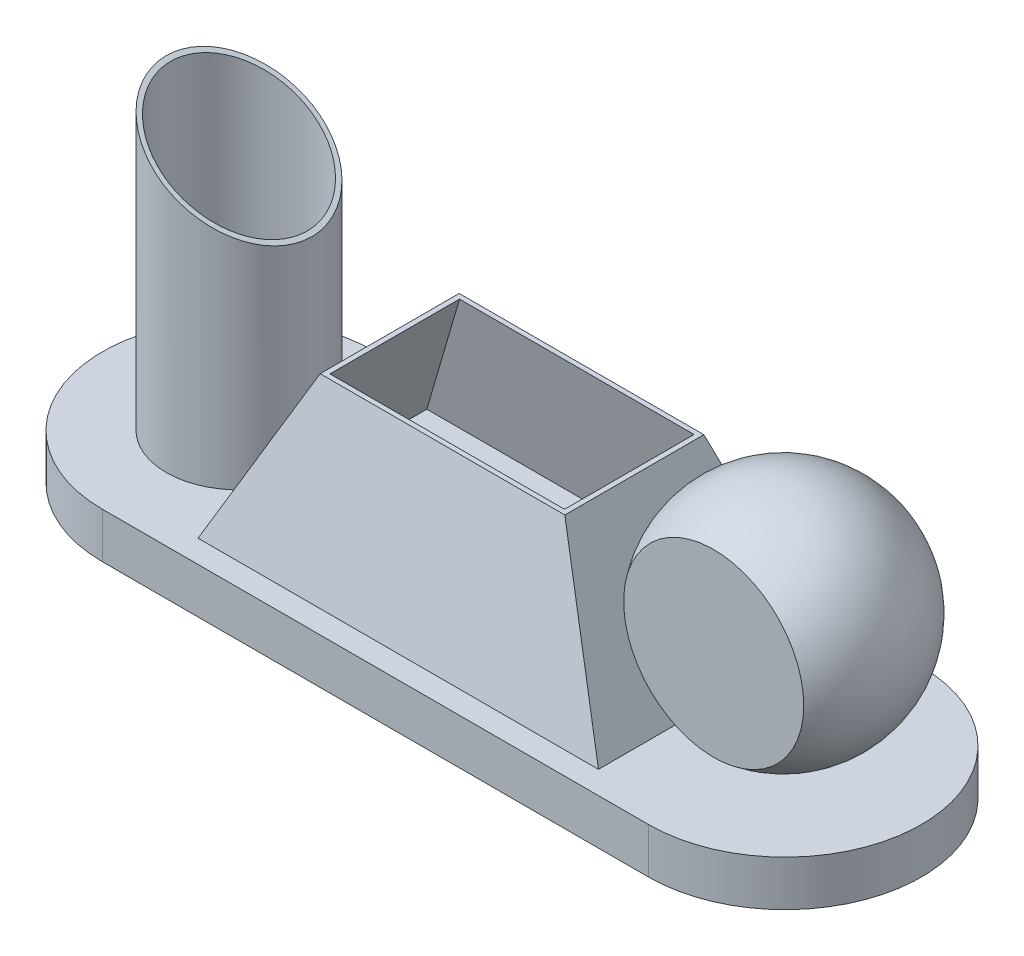
ISO-10303-21;
HEADER;
FILE_DESCRIPTION(('STEP AP214'),'2;1');
FILE_NAME('part.step','',(''),(''),'','','');
FILE_SCHEMA(('AUTOMOTIVE_DESIGN { 1 0 10303 214 1 1 1 1 }'));
ENDSEC;
DATA;
#1=APPLICATION_CONTEXT('core data for automotive mechanical design processes');
#2=APPLICATION_PROTOCOL_DEFINITION('international standard','automotive_design',2000,#1);
#3=PRODUCT_CONTEXT('',#1,'mechanical');
#4=PRODUCT('Part','Part','',(#3));
#5=PRODUCT_RELATED_PRODUCT_CATEGORY('part','',(#4));
#6=PRODUCT_DEFINITION_FORMATION('','',#4);
#7=PRODUCT_DEFINITION_CONTEXT('part definition',#1,'design');
#8=PRODUCT_DEFINITION('design','',#6,#7);
#9=PRODUCT_DEFINITION_SHAPE('','',#8);
#10=(LENGTH_UNIT() NAMED_UNIT(*) SI_UNIT(.MILLI.,.METRE.));
#11=(NAMED_UNIT(*) PLANE_ANGLE_UNIT() SI_UNIT($,.RADIAN.));
#12=(NAMED_UNIT(*) SI_UNIT($,.STERADIAN.) SOLID_ANGLE_UNIT());
#13=UNCERTAINTY_MEASURE_WITH_UNIT(LENGTH_MEASURE(1.E-05),#10,'distance_accuracy_value','');
#14=(GEOMETRIC_REPRESENTATION_CONTEXT(3) GLOBAL_UNCERTAINTY_ASSIGNED_CONTEXT((#13)) GLOBAL_UNIT_ASSIGNED_CONTEXT((#10,
#11,#12)) REPRESENTATION_CONTEXT('',''));
#15=CARTESIAN_POINT('',(0.,0.,0.));
#16=DIRECTION('',(0.,0.,1.));
#17=DIRECTION('',(1.,0.,0.));
#18=AXIS2_PLACEMENT_3D('',#15,#16,#17);
#19=CARTESIAN_POINT('',(59.6055106363738,35.,0.));
#20=DIRECTION('',(0.,1.,0.));
#21=DIRECTION('',(1.,0.,0.));
#22=AXIS2_PLACEMENT_3D('',#19,#20,#21);
#23=SPHERICAL_SURFACE('',#22,25.);
#24=CARTESIAN_POINT('',(59.6055106363738,35.,0.));
#25=DIRECTION('',(0.,0.,1.));
#26=DIRECTION('',(1.,0.,0.));
#27=AXIS2_PLACEMENT_3D('',#24,#25,#26);
#28=SPHERICAL_SURFACE('',#27,25.);
#29=CARTESIAN_POINT('',(59.6055106363738,35.,15.2777777777778));
#30=DIRECTION('',(0.,0.,1.));
#31=DIRECTION('',(1.,0.,0.));
#32=AXIS2_PLACEMENT_3D('',#29,#30,#31);
#33=CIRCLE('',#32,19.7886206232986);
#34=CARTESIAN_POINT('',(79.3941312596724,35.,15.2777777777778));
#35=VERTEX_POINT('',#34);
#36=EDGE_CURVE('E12',#35,#35,#33,.F.);
#37=ORIENTED_EDGE('',*,*,#36,.T.);
#38=EDGE_LOOP('',(#37));
#39=FACE_BOUND('',#38,.T.);
#40=ADVANCED_FACE('F44',(#39),#28,.T.);
#41=CARTESIAN_POINT('',(59.6055106363738,35.,15.2777777777778));
#42=DIRECTION('',(0.,0.,1.));
#43=DIRECTION('',(1.,0.,0.));
#44=AXIS2_PLACEMENT_3D('',#41,#42,#43);
#45=PLANE('',#44);
#46=ORIENTED_EDGE('',*,*,#36,.F.);
#47=EDGE_LOOP('',(#46));
#48=FACE_BOUND('',#47,.T.);
#49=ADVANCED_FACE('F52',(#48),#45,.T.);
#50=CLOSED_SHELL('',(#40,#49));
#51=MANIFOLD_SOLID_BREP('B2',#50);
#52=CARTESIAN_POINT('',(-60.,100.,0.));
#53=DIRECTION('',(0.,-1.,0.));
#54=DIRECTION('',(0.,0.,-1.));
#55=AXIS2_PLACEMENT_3D('',#52,#53,#54);
#56=CYLINDRICAL_SURFACE('',#55,16.);
#57=CARTESIAN_POINT('',(-60.,64.1167089131678,0.));
#58=DIRECTION('',(-0.500000000000004,-0.866025403784436,0.));
#59=DIRECTION('',(0.866025403784436,-0.500000000000004,0.));
#60=AXIS2_PLACEMENT_3D('',#57,#58,#59);
#61=ELLIPSE('',#60,18.4752086140681,16.);
#62=CARTESIAN_POINT('',(-44.,54.8791046061337,0.));
#63=VERTEX_POINT('',#62);
#64=EDGE_CURVE('E83',#63,#63,#61,.T.);
#65=ORIENTED_EDGE('',*,*,#64,.T.);
#66=EDGE_LOOP('',(#65));
#67=FACE_BOUND('',#66,.T.);
#68=CARTESIAN_POINT('',(-60.,10.,0.));
#69=DIRECTION('',(0.,1.,0.));
#70=DIRECTION('',(0.,0.,1.));
#71=AXIS2_PLACEMENT_3D('',#68,#69,#70);
#72=CIRCLE('',#71,16.);
#73=CARTESIAN_POINT('',(-60.,10.,16.));
#74=VERTEX_POINT('',#73);
#75=EDGE_CURVE('E43',#74,#74,#72,.T.);
#76=ORIENTED_EDGE('',*,*,#75,.T.);
#77=EDGE_LOOP('',(#76));
#78=FACE_BOUND('',#77,.T.);
#79=ADVANCED_FACE('F80',(#67,#78),#56,.T.);
#80=CARTESIAN_POINT('',(-60.,10.,0.));
#81=DIRECTION('',(0.,1.,0.));
#82=DIRECTION('',(0.,0.,1.));
#83=AXIS2_PLACEMENT_3D('',#80,#81,#82);
#84=PLANE('',#83);
#85=ORIENTED_EDGE('',*,*,#75,.F.);
#86=EDGE_LOOP('',(#85));
#87=FACE_BOUND('',#86,.T.);
#88=ADVANCED_FACE('F110',(#87),#84,.F.);
#89=CARTESIAN_POINT('',(-26.8888888888889,45.,-45.));
#90=DIRECTION('',(-0.500000000000004,-0.866025403784436,0.));
#91=DIRECTION('',(0.866025403784436,-0.500000000000004,0.));
#92=AXIS2_PLACEMENT_3D('',#89,#90,#91);
#93=PLANE('',#92);
#94=CARTESIAN_POINT('',(-60.,64.1167089131678,0.));
#95=DIRECTION('',(-0.500000000000004,-0.866025403784436,0.));
#96=DIRECTION('',(0.866025403784436,-0.500000000000004,0.));
#97=AXIS2_PLACEMENT_3D('',#94,#95,#96);
#98=ELLIPSE('',#97,17.3205080756888,15.);
#99=CARTESIAN_POINT('',(-45.,55.4564548753233,0.));
#100=VERTEX_POINT('',#99);
#101=EDGE_CURVE('E92',#100,#100,#98,.T.);
#102=ORIENTED_EDGE('',*,*,#101,.T.);
#103=EDGE_LOOP('',(#102));
#104=FACE_BOUND('',#103,.T.);
#105=ORIENTED_EDGE('',*,*,#64,.F.);
#106=EDGE_LOOP('',(#105));
#107=FACE_BOUND('',#106,.T.);
#108=ADVANCED_FACE('F102',(#104,#107),#93,.F.);
#109=CARTESIAN_POINT('',(-60.,100.,0.));
#110=DIRECTION('',(0.,-1.,0.));
#111=DIRECTION('',(0.,0.,-1.));
#112=AXIS2_PLACEMENT_3D('',#109,#110,#111);
#113=CYLINDRICAL_SURFACE('',#112,15.);
#114=ORIENTED_EDGE('',*,*,#101,.F.);
#115=EDGE_LOOP('',(#114));
#116=FACE_BOUND('',#115,.T.);
#117=CARTESIAN_POINT('',(-60.,11.,0.));
#118=DIRECTION('',(0.,1.,0.));
#119=DIRECTION('',(0.,0.,1.));
#120=AXIS2_PLACEMENT_3D('',#117,#118,#119);
#121=CIRCLE('',#120,15.);
#122=CARTESIAN_POINT('',(-60.,11.,15.));
#123=VERTEX_POINT('',#122);
#124=EDGE_CURVE('E90',#123,#123,#121,.T.);
#125=ORIENTED_EDGE('',*,*,#124,.F.);
#126=EDGE_LOOP('',(#125));
#127=FACE_BOUND('',#126,.T.);
#128=ADVANCED_FACE('F100',(#116,#127),#113,.F.);
#129=CARTESIAN_POINT('',(-60.,11.,0.));
#130=DIRECTION('',(0.,1.,0.));
#131=DIRECTION('',(0.,0.,1.));
#132=AXIS2_PLACEMENT_3D('',#129,#130,#131);
#133=PLANE('',#132);
#134=ORIENTED_EDGE('',*,*,#124,.T.);
#135=EDGE_LOOP('',(#134));
#136=FACE_BOUND('',#135,.T.);
#137=ADVANCED_FACE('F98',(#136),#133,.T.);
#138=CLOSED_SHELL('',(#79,#88,#108,#128,#137));
#139=MANIFOLD_SOLID_BREP('B7',#138);
#140=CARTESIAN_POINT('',(44.,10.,25.));
#141=DIRECTION('',(0.,1.,0.));
#142=DIRECTION('',(0.,0.,1.));
#143=AXIS2_PLACEMENT_3D('',#140,#141,#142);
#144=PLANE('',#143);
#145=DIRECTION('',(0.,0.,-1.));
#146=VECTOR('',#145,1.);
#147=CARTESIAN_POINT('',(44.,10.,-25.));
#148=LINE('',#147,#146);
#149=CARTESIAN_POINT('',(44.,10.,25.));
#150=VERTEX_POINT('',#149);
#151=CARTESIAN_POINT('',(44.,10.,-25.));
#152=VERTEX_POINT('',#151);
#153=EDGE_CURVE('E380',#150,#152,#148,.T.);
#154=ORIENTED_EDGE('',*,*,#153,.F.);
#155=DIRECTION('',(1.,0.,0.));
#156=VECTOR('',#155,1.);
#157=CARTESIAN_POINT('',(-44.,10.,25.));
#158=LINE('',#157,#156);
#159=CARTESIAN_POINT('',(-44.,10.,25.));
#160=VERTEX_POINT('',#159);
#161=EDGE_CURVE('E373',#160,#150,#158,.T.);
#162=ORIENTED_EDGE('',*,*,#161,.F.);
#163=DIRECTION('',(0.,0.,1.));
#164=VECTOR('',#163,1.);
#165=CARTESIAN_POINT('',(-44.,10.,-25.));
#166=LINE('',#165,#164);
#167=CARTESIAN_POINT('',(-44.,10.,-25.));
#168=VERTEX_POINT('',#167);
#169=EDGE_CURVE('E300',#168,#160,#166,.T.);
#170=ORIENTED_EDGE('',*,*,#169,.F.);
#171=DIRECTION('',(-1.,0.,0.));
#172=VECTOR('',#171,1.);
#173=CARTESIAN_POINT('',(-44.,10.,-25.));
#174=LINE('',#173,#172);
#175=EDGE_CURVE('E169',#152,#168,#174,.T.);
#176=ORIENTED_EDGE('',*,*,#175,.F.);
#177=EDGE_LOOP('',(#154,#162,#170,#176));
#178=FACE_BOUND('',#177,.T.);
#179=ADVANCED_FACE('F160',(#178),#144,.F.);
#180=CARTESIAN_POINT('',(44.,10.,25.));
#181=DIRECTION('',(0.,-0.267643863786095,-0.963517909629941));
#182=DIRECTION('',(0.,0.963517909629941,-0.267643863786095));
#183=AXIS2_PLACEMENT_3D('',#180,#181,#182);
#184=PLANE('',#183);
#185=DIRECTION('',(-0.426141376923608,0.871652816434652,-0.242125782342959));
#186=VECTOR('',#185,1.);
#187=CARTESIAN_POINT('',(44.,10.,25.));
#188=LINE('',#187,#186);
#189=CARTESIAN_POINT('',(26.8888888888889,45.,15.2777777777778));
#190=VERTEX_POINT('',#189);
#191=EDGE_CURVE('E291',#150,#190,#188,.T.);
#192=ORIENTED_EDGE('',*,*,#191,.T.);
#193=DIRECTION('',(-1.,0.,0.));
#194=VECTOR('',#193,1.);
#195=CARTESIAN_POINT('',(44.,45.,15.2777777777778));
#196=LINE('',#195,#194);
#197=CARTESIAN_POINT('',(-26.8888888888889,45.,15.2777777777778));
#198=VERTEX_POINT('',#197);
#199=EDGE_CURVE('E270',#190,#198,#196,.T.);
#200=ORIENTED_EDGE('',*,*,#199,.T.);
#201=DIRECTION('',(0.426141376923608,0.871652816434652,-0.242125782342959));
#202=VECTOR('',#201,1.);
#203=CARTESIAN_POINT('',(-44.,10.,25.));
#204=LINE('',#203,#202);
#205=EDGE_CURVE('E306',#160,#198,#204,.T.);
#206=ORIENTED_EDGE('',*,*,#205,.F.);
#207=ORIENTED_EDGE('',*,*,#161,.T.);
#208=EDGE_LOOP('',(#192,#200,#206,#207));
#209=FACE_BOUND('',#208,.T.);
#210=ADVANCED_FACE('F318',(#209),#184,.F.);
#211=CARTESIAN_POINT('',(-44.,10.,25.));
#212=DIRECTION('',(0.898384360919201,-0.439210132004943,0.));
#213=DIRECTION('',(0.439210132004943,0.898384360919201,0.));
#214=AXIS2_PLACEMENT_3D('',#211,#212,#213);
#215=PLANE('',#214);
#216=ORIENTED_EDGE('',*,*,#205,.T.);
#217=DIRECTION('',(0.,0.,-1.));
#218=VECTOR('',#217,1.);
#219=CARTESIAN_POINT('',(-26.8888888888889,45.,25.));
#220=LINE('',#219,#218);
#221=CARTESIAN_POINT('',(-26.8888888888889,45.,-15.2777777777778));
#222=VERTEX_POINT('',#221);
#223=EDGE_CURVE('E267',#198,#222,#220,.T.);
#224=ORIENTED_EDGE('',*,*,#223,.T.);
#225=DIRECTION('',(0.426141376923608,0.871652816434652,0.242125782342959));
#226=VECTOR('',#225,1.);
#227=CARTESIAN_POINT('',(-44.,10.,-25.));
#228=LINE('',#227,#226);
#229=EDGE_CURVE('E273',#168,#222,#228,.T.);
#230=ORIENTED_EDGE('',*,*,#229,.F.);
#231=ORIENTED_EDGE('',*,*,#169,.T.);
#232=EDGE_LOOP('',(#216,#224,#230,#231));
#233=FACE_BOUND('',#232,.T.);
#234=ADVANCED_FACE('F308',(#233),#215,.F.);
#235=CARTESIAN_POINT('',(44.,10.,-25.));
#236=DIRECTION('',(-0.898384360919201,-0.439210132004943,0.));
#237=DIRECTION('',(0.439210132004943,-0.898384360919201,0.));
#238=AXIS2_PLACEMENT_3D('',#235,#236,#237);
#239=PLANE('',#238);
#240=DIRECTION('',(0.,0.,1.));
#241=VECTOR('',#240,1.);
#242=CARTESIAN_POINT('',(26.8888888888889,45.,-25.));
#243=LINE('',#242,#241);
#244=CARTESIAN_POINT('',(26.8888888888889,45.,-15.2777777777778));
#245=VERTEX_POINT('',#244);
#246=EDGE_CURVE('E184',#245,#190,#243,.T.);
#247=ORIENTED_EDGE('',*,*,#246,.T.);
#248=ORIENTED_EDGE('',*,*,#191,.F.);
#249=ORIENTED_EDGE('',*,*,#153,.T.);
#250=DIRECTION('',(-0.426141376923608,0.871652816434652,0.242125782342959));
#251=VECTOR('',#250,1.);
#252=CARTESIAN_POINT('',(44.,10.,-25.));
#253=LINE('',#252,#251);
#254=EDGE_CURVE('E283',#152,#245,#253,.T.);
#255=ORIENTED_EDGE('',*,*,#254,.T.);
#256=EDGE_LOOP('',(#247,#248,#249,#255));
#257=FACE_BOUND('',#256,.T.);
#258=ADVANCED_FACE('F317',(#257),#239,.F.);
#259=CARTESIAN_POINT('',(-44.,10.,-25.));
#260=DIRECTION('',(0.,-0.267643863786095,0.963517909629941));
#261=DIRECTION('',(0.,-0.963517909629941,-0.267643863786095));
#262=AXIS2_PLACEMENT_3D('',#259,#260,#261);
#263=PLANE('',#262);
#264=ORIENTED_EDGE('',*,*,#229,.T.);
#265=DIRECTION('',(1.,0.,0.));
#266=VECTOR('',#265,1.);
#267=CARTESIAN_POINT('',(-44.,45.,-15.2777777777778));
#268=LINE('',#267,#266);
#269=EDGE_CURVE('E78',#222,#245,#268,.T.);
#270=ORIENTED_EDGE('',*,*,#269,.T.);
#271=ORIENTED_EDGE('',*,*,#254,.F.);
#272=ORIENTED_EDGE('',*,*,#175,.T.);
#273=EDGE_LOOP('',(#264,#270,#271,#272));
#274=FACE_BOUND('',#273,.T.);
#275=ADVANCED_FACE('F162',(#274),#263,.F.);
#276=CARTESIAN_POINT('',(-46.4512403843567,45.,-25.));
#277=DIRECTION('',(0.,-1.,0.));
#278=DIRECTION('',(0.,0.,-1.));
#279=AXIS2_PLACEMENT_3D('',#276,#277,#278);
#280=PLANE('',#279);
#281=DIRECTION('',(1.,0.,0.));
#282=VECTOR('',#281,1.);
#283=CARTESIAN_POINT('',(-44.,45.,-14.2399143504295));
#284=LINE('',#283,#282);
#285=CARTESIAN_POINT('',(-25.775779574545,45.,-14.2399143504295));
#286=VERTEX_POINT('',#285);
#287=CARTESIAN_POINT('',(25.7757795745451,45.,-14.2399143504295));
#288=VERTEX_POINT('',#287);
#289=EDGE_CURVE('E252',#286,#288,#284,.T.);
#290=ORIENTED_EDGE('',*,*,#289,.T.);
#291=DIRECTION('',(0.,0.,1.));
#292=VECTOR('',#291,1.);
#293=CARTESIAN_POINT('',(25.7757795745451,45.,-25.));
#294=LINE('',#293,#292);
#295=CARTESIAN_POINT('',(25.7757795745451,45.,14.2399143504295));
#296=VERTEX_POINT('',#295);
#297=EDGE_CURVE('E260',#288,#296,#294,.T.);
#298=ORIENTED_EDGE('',*,*,#297,.T.);
#299=DIRECTION('',(-1.,0.,0.));
#300=VECTOR('',#299,1.);
#301=CARTESIAN_POINT('',(44.,45.,14.2399143504295));
#302=LINE('',#301,#300);
#303=CARTESIAN_POINT('',(-25.775779574545,45.,14.2399143504295));
#304=VERTEX_POINT('',#303);
#305=EDGE_CURVE('E240',#296,#304,#302,.T.);
#306=ORIENTED_EDGE('',*,*,#305,.T.);
#307=DIRECTION('',(0.,0.,-1.));
#308=VECTOR('',#307,1.);
#309=CARTESIAN_POINT('',(-25.775779574545,45.,25.));
#310=LINE('',#309,#308);
#311=EDGE_CURVE('E259',#304,#286,#310,.T.);
#312=ORIENTED_EDGE('',*,*,#311,.T.);
#313=EDGE_LOOP('',(#290,#298,#306,#312));
#314=FACE_BOUND('',#313,.T.);
#315=ORIENTED_EDGE('',*,*,#246,.F.);
#316=ORIENTED_EDGE('',*,*,#269,.F.);
#317=ORIENTED_EDGE('',*,*,#223,.F.);
#318=ORIENTED_EDGE('',*,*,#199,.F.);
#319=EDGE_LOOP('',(#315,#316,#317,#318));
#320=FACE_BOUND('',#319,.T.);
#321=ADVANCED_FACE('F360',(#314,#320),#280,.F.);
#322=CARTESIAN_POINT('',(44.,11.,25.));
#323=DIRECTION('',(0.,1.,0.));
#324=DIRECTION('',(0.,0.,1.));
#325=AXIS2_PLACEMENT_3D('',#322,#323,#324);
#326=PLANE('',#325);
#327=DIRECTION('',(0.,0.,-1.));
#328=VECTOR('',#327,1.);
#329=CARTESIAN_POINT('',(42.3980017967673,11.,-25.));
#330=LINE('',#329,#328);
#331=CARTESIAN_POINT('',(42.3980017967673,11.,23.6843587948739));
#332=VERTEX_POINT('',#331);
#333=CARTESIAN_POINT('',(42.3980017967673,11.,-23.6843587948739));
#334=VERTEX_POINT('',#333);
#335=EDGE_CURVE('E231',#332,#334,#330,.T.);
#336=ORIENTED_EDGE('',*,*,#335,.T.);
#337=DIRECTION('',(-1.,0.,0.));
#338=VECTOR('',#337,1.);
#339=CARTESIAN_POINT('',(-44.,11.,-23.6843587948739));
#340=LINE('',#339,#338);
#341=CARTESIAN_POINT('',(-42.3980017967673,11.,-23.6843587948739));
#342=VERTEX_POINT('',#341);
#343=EDGE_CURVE('E251',#334,#342,#340,.T.);
#344=ORIENTED_EDGE('',*,*,#343,.T.);
#345=DIRECTION('',(0.,0.,1.));
#346=VECTOR('',#345,1.);
#347=CARTESIAN_POINT('',(-42.3980017967673,11.,25.));
#348=LINE('',#347,#346);
#349=CARTESIAN_POINT('',(-42.3980017967673,11.,23.6843587948739));
#350=VERTEX_POINT('',#349);
#351=EDGE_CURVE('E234',#342,#350,#348,.T.);
#352=ORIENTED_EDGE('',*,*,#351,.T.);
#353=DIRECTION('',(1.,0.,0.));
#354=VECTOR('',#353,1.);
#355=CARTESIAN_POINT('',(44.,11.,23.6843587948739));
#356=LINE('',#355,#354);
#357=EDGE_CURVE('E226',#350,#332,#356,.T.);
#358=ORIENTED_EDGE('',*,*,#357,.T.);
#359=EDGE_LOOP('',(#336,#344,#352,#358));
#360=FACE_BOUND('',#359,.T.);
#361=ADVANCED_FACE('F228',(#360),#326,.T.);
#362=CARTESIAN_POINT('',(44.,9.73235613621391,24.0364820903701));
#363=DIRECTION('',(0.,-0.267643863786095,-0.963517909629941));
#364=DIRECTION('',(0.,0.963517909629941,-0.267643863786095));
#365=AXIS2_PLACEMENT_3D('',#362,#363,#364);
#366=PLANE('',#365);
#367=DIRECTION('',(-0.426141376923608,0.871652816434652,-0.242125782342959));
#368=VECTOR('',#367,1.);
#369=CARTESIAN_POINT('',(43.1961139670231,9.36749783356765,24.1378316188829));
#370=LINE('',#369,#368);
#371=EDGE_CURVE('E237',#332,#296,#370,.T.);
#372=ORIENTED_EDGE('',*,*,#371,.F.);
#373=ORIENTED_EDGE('',*,*,#357,.F.);
#374=DIRECTION('',(0.426141376923608,0.871652816434652,-0.242125782342959));
#375=VECTOR('',#374,1.);
#376=CARTESIAN_POINT('',(-43.1961139670231,9.36749783356765,24.1378316188829));
#377=LINE('',#376,#375);
#378=EDGE_CURVE('E176',#350,#304,#377,.T.);
#379=ORIENTED_EDGE('',*,*,#378,.T.);
#380=ORIENTED_EDGE('',*,*,#305,.F.);
#381=EDGE_LOOP('',(#372,#373,#379,#380));
#382=FACE_BOUND('',#381,.T.);
#383=ADVANCED_FACE('F238',(#382),#366,.T.);
#384=CARTESIAN_POINT('',(-43.1016156390808,9.56078986799506,25.));
#385=DIRECTION('',(0.898384360919201,-0.439210132004943,0.));
#386=DIRECTION('',(0.439210132004943,0.898384360919201,0.));
#387=AXIS2_PLACEMENT_3D('',#384,#385,#386);
#388=PLANE('',#387);
#389=ORIENTED_EDGE('',*,*,#378,.F.);
#390=ORIENTED_EDGE('',*,*,#351,.F.);
#391=DIRECTION('',(0.426141376923608,0.871652816434652,0.242125782342959));
#392=VECTOR('',#391,1.);
#393=CARTESIAN_POINT('',(-43.1961139670231,9.36749783356765,-24.1378316188829));
#394=LINE('',#393,#392);
#395=EDGE_CURVE('E254',#342,#286,#394,.T.);
#396=ORIENTED_EDGE('',*,*,#395,.T.);
#397=ORIENTED_EDGE('',*,*,#311,.F.);
#398=EDGE_LOOP('',(#389,#390,#396,#397));
#399=FACE_BOUND('',#398,.T.);
#400=ADVANCED_FACE('F449',(#399),#388,.T.);
#401=CARTESIAN_POINT('',(43.1016156390808,9.56078986799506,-25.));
#402=DIRECTION('',(-0.898384360919201,-0.439210132004943,0.));
#403=DIRECTION('',(0.439210132004943,-0.898384360919201,0.));
#404=AXIS2_PLACEMENT_3D('',#401,#402,#403);
#405=PLANE('',#404);
#406=DIRECTION('',(-0.426141376923608,0.871652816434652,0.242125782342959));
#407=VECTOR('',#406,1.);
#408=CARTESIAN_POINT('',(43.1961139670231,9.36749783356765,-24.1378316188829));
#409=LINE('',#408,#407);
#410=EDGE_CURVE('E243',#334,#288,#409,.T.);
#411=ORIENTED_EDGE('',*,*,#410,.F.);
#412=ORIENTED_EDGE('',*,*,#335,.F.);
#413=ORIENTED_EDGE('',*,*,#371,.T.);
#414=ORIENTED_EDGE('',*,*,#297,.F.);
#415=EDGE_LOOP('',(#411,#412,#413,#414));
#416=FACE_BOUND('',#415,.T.);
#417=ADVANCED_FACE('F245',(#416),#405,.T.);
#418=CARTESIAN_POINT('',(-44.,9.73235613621391,-24.0364820903701));
#419=DIRECTION('',(0.,-0.267643863786095,0.963517909629941));
#420=DIRECTION('',(0.,-0.963517909629941,-0.267643863786095));
#421=AXIS2_PLACEMENT_3D('',#418,#419,#420);
#422=PLANE('',#421);
#423=ORIENTED_EDGE('',*,*,#395,.F.);
#424=ORIENTED_EDGE('',*,*,#343,.F.);
#425=ORIENTED_EDGE('',*,*,#410,.T.);
#426=ORIENTED_EDGE('',*,*,#289,.F.);
#427=EDGE_LOOP('',(#423,#424,#425,#426));
#428=FACE_BOUND('',#427,.T.);
#429=ADVANCED_FACE('F411',(#428),#422,.T.);
#430=CLOSED_SHELL('',(#179,#210,#234,#258,#275,#321,#361,#383,#400,#417,#429));
#431=MANIFOLD_SOLID_BREP('B38',#430);
#432=CARTESIAN_POINT('',(-60.,10.,0.));
#433=DIRECTION('',(0.,-1.,0.));
#434=DIRECTION('',(0.,0.,-1.));
#435=AXIS2_PLACEMENT_3D('',#432,#433,#434);
#436=CYLINDRICAL_SURFACE('',#435,30.);
#437=CARTESIAN_POINT('',(-60.,0.,0.));
#438=DIRECTION('',(0.,1.,0.));
#439=DIRECTION('',(0.,0.,1.));
#440=AXIS2_PLACEMENT_3D('',#437,#438,#439);
#441=CIRCLE('',#440,30.);
#442=CARTESIAN_POINT('',(-60.,0.,-30.));
#443=VERTEX_POINT('',#442);
#444=CARTESIAN_POINT('',(-60.,0.,30.));
#445=VERTEX_POINT('',#444);
#446=EDGE_CURVE('E554',#443,#445,#441,.T.);
#447=ORIENTED_EDGE('',*,*,#446,.T.);
#448=DIRECTION('',(0.,-1.,0.));
#449=VECTOR('',#448,1.);
#450=CARTESIAN_POINT('',(-60.,10.,30.));
#451=LINE('',#450,#449);
#452=CARTESIAN_POINT('',(-60.,10.,30.));
#453=VERTEX_POINT('',#452);
#454=EDGE_CURVE('E158',#453,#445,#451,.T.);
#455=ORIENTED_EDGE('',*,*,#454,.F.);
#456=CARTESIAN_POINT('',(-60.,10.,0.));
#457=DIRECTION('',(0.,1.,0.));
#458=DIRECTION('',(0.,0.,1.));
#459=AXIS2_PLACEMENT_3D('',#456,#457,#458);
#460=CIRCLE('',#459,30.);
#461=CARTESIAN_POINT('',(-60.,10.,-30.));
#462=VERTEX_POINT('',#461);
#463=EDGE_CURVE('E542',#462,#453,#460,.T.);
#464=ORIENTED_EDGE('',*,*,#463,.F.);
#465=DIRECTION('',(0.,-1.,0.));
#466=VECTOR('',#465,1.);
#467=CARTESIAN_POINT('',(-60.,10.,-30.));
#468=LINE('',#467,#466);
#469=EDGE_CURVE('E550',#462,#443,#468,.T.);
#470=ORIENTED_EDGE('',*,*,#469,.T.);
#471=EDGE_LOOP('',(#447,#455,#464,#470));
#472=FACE_BOUND('',#471,.T.);
#473=ADVANCED_FACE('F491',(#472),#436,.T.);
#474=CARTESIAN_POINT('',(-60.,10.,30.));
#475=DIRECTION('',(0.,0.,-1.));
#476=DIRECTION('',(-1.,0.,0.));
#477=AXIS2_PLACEMENT_3D('',#474,#475,#476);
#478=PLANE('',#477);
#479=DIRECTION('',(1.,0.,0.));
#480=VECTOR('',#479,1.);
#481=CARTESIAN_POINT('',(-60.,0.,30.));
#482=LINE('',#481,#480);
#483=CARTESIAN_POINT('',(60.,0.,30.));
#484=VERTEX_POINT('',#483);
#485=EDGE_CURVE('E546',#445,#484,#482,.T.);
#486=ORIENTED_EDGE('',*,*,#485,.T.);
#487=DIRECTION('',(0.,-1.,0.));
#488=VECTOR('',#487,1.);
#489=CARTESIAN_POINT('',(60.,10.,30.));
#490=LINE('',#489,#488);
#491=CARTESIAN_POINT('',(60.,10.,30.));
#492=VERTEX_POINT('',#491);
#493=EDGE_CURVE('E499',#492,#484,#490,.T.);
#494=ORIENTED_EDGE('',*,*,#493,.F.);
#495=DIRECTION('',(1.,0.,0.));
#496=VECTOR('',#495,1.);
#497=CARTESIAN_POINT('',(-60.,10.,30.));
#498=LINE('',#497,#496);
#499=EDGE_CURVE('E537',#453,#492,#498,.T.);
#500=ORIENTED_EDGE('',*,*,#499,.F.);
#501=ORIENTED_EDGE('',*,*,#454,.T.);
#502=EDGE_LOOP('',(#486,#494,#500,#501));
#503=FACE_BOUND('',#502,.T.);
#504=ADVANCED_FACE('F545',(#503),#478,.F.);
#505=CARTESIAN_POINT('',(60.,10.,0.));
#506=DIRECTION('',(0.,-1.,0.));
#507=DIRECTION('',(0.,0.,-1.));
#508=AXIS2_PLACEMENT_3D('',#505,#506,#507);
#509=CYLINDRICAL_SURFACE('',#508,30.);
#510=CARTESIAN_POINT('',(60.,0.,0.));
#511=DIRECTION('',(0.,1.,0.));
#512=DIRECTION('',(0.,0.,1.));
#513=AXIS2_PLACEMENT_3D('',#510,#511,#512);
#514=CIRCLE('',#513,30.);
#515=CARTESIAN_POINT('',(60.,0.,-30.));
#516=VERTEX_POINT('',#515);
#517=EDGE_CURVE('E524',#484,#516,#514,.T.);
#518=ORIENTED_EDGE('',*,*,#517,.T.);
#519=DIRECTION('',(0.,-1.,0.));
#520=VECTOR('',#519,1.);
#521=CARTESIAN_POINT('',(60.,10.,-30.));
#522=LINE('',#521,#520);
#523=CARTESIAN_POINT('',(60.,10.,-30.));
#524=VERTEX_POINT('',#523);
#525=EDGE_CURVE('E547',#524,#516,#522,.T.);
#526=ORIENTED_EDGE('',*,*,#525,.F.);
#527=CARTESIAN_POINT('',(60.,10.,0.));
#528=DIRECTION('',(0.,1.,0.));
#529=DIRECTION('',(0.,0.,1.));
#530=AXIS2_PLACEMENT_3D('',#527,#528,#529);
#531=CIRCLE('',#530,30.);
#532=EDGE_CURVE('E540',#492,#524,#531,.T.);
#533=ORIENTED_EDGE('',*,*,#532,.F.);
#534=ORIENTED_EDGE('',*,*,#493,.T.);
#535=EDGE_LOOP('',(#518,#526,#533,#534));
#536=FACE_BOUND('',#535,.T.);
#537=ADVANCED_FACE('F548',(#536),#509,.T.);
#538=CARTESIAN_POINT('',(-60.,10.,-30.));
#539=DIRECTION('',(0.,0.,1.));
#540=DIRECTION('',(1.,0.,0.));
#541=AXIS2_PLACEMENT_3D('',#538,#539,#540);
#542=PLANE('',#541);
#543=DIRECTION('',(-1.,0.,0.));
#544=VECTOR('',#543,1.);
#545=CARTESIAN_POINT('',(-60.,0.,-30.));
#546=LINE('',#545,#544);
#547=EDGE_CURVE('E530',#516,#443,#546,.T.);
#548=ORIENTED_EDGE('',*,*,#547,.T.);
#549=ORIENTED_EDGE('',*,*,#469,.F.);
#550=DIRECTION('',(-1.,0.,0.));
#551=VECTOR('',#550,1.);
#552=CARTESIAN_POINT('',(-60.,10.,-30.));
#553=LINE('',#552,#551);
#554=EDGE_CURVE('E507',#524,#462,#553,.T.);
#555=ORIENTED_EDGE('',*,*,#554,.F.);
#556=ORIENTED_EDGE('',*,*,#525,.T.);
#557=EDGE_LOOP('',(#548,#549,#555,#556));
#558=FACE_BOUND('',#557,.T.);
#559=ADVANCED_FACE('F561',(#558),#542,.F.);
#560=CARTESIAN_POINT('',(-60.,10.,0.));
#561=DIRECTION('',(0.,1.,0.));
#562=DIRECTION('',(0.,0.,1.));
#563=AXIS2_PLACEMENT_3D('',#560,#561,#562);
#564=PLANE('',#563);
#565=ORIENTED_EDGE('',*,*,#499,.T.);
#566=ORIENTED_EDGE('',*,*,#532,.T.);
#567=ORIENTED_EDGE('',*,*,#554,.T.);
#568=ORIENTED_EDGE('',*,*,#463,.T.);
#569=EDGE_LOOP('',(#565,#566,#567,#568));
#570=FACE_BOUND('',#569,.T.);
#571=ADVANCED_FACE('F538',(#570),#564,.T.);
#572=CARTESIAN_POINT('',(-60.,0.,0.));
#573=DIRECTION('',(0.,1.,0.));
#574=DIRECTION('',(0.,0.,1.));
#575=AXIS2_PLACEMENT_3D('',#572,#573,#574);
#576=PLANE('',#575);
#577=ORIENTED_EDGE('',*,*,#446,.F.);
#578=ORIENTED_EDGE('',*,*,#547,.F.);
#579=ORIENTED_EDGE('',*,*,#517,.F.);
#580=ORIENTED_EDGE('',*,*,#485,.F.);
#581=EDGE_LOOP('',(#577,#578,#579,#580));
#582=FACE_BOUND('',#581,.T.);
#583=ADVANCED_FACE('F564',(#582),#576,.F.);
#584=CLOSED_SHELL('',(#473,#504,#537,#559,#571,#583));
#585=MANIFOLD_SOLID_BREP('B72',#584);
#586=ADVANCED_BREP_SHAPE_REPRESENTATION('',(#18,#51,#139,#431,#585),#14);
#587=SHAPE_DEFINITION_REPRESENTATION(#9,#586);
ENDSEC;
END-ISO-10303-21;
